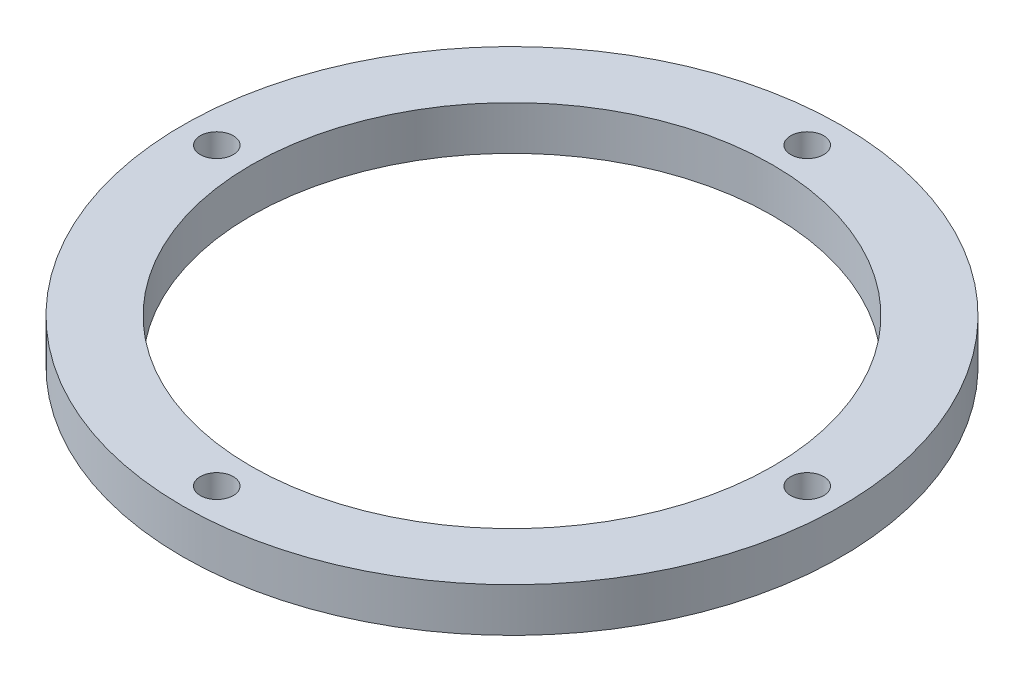
ISO-10303-21;
HEADER;
FILE_DESCRIPTION(('STEP AP214'),'2;1');
FILE_NAME('part.step','',(''),(''),'','','');
FILE_SCHEMA(('AUTOMOTIVE_DESIGN { 1 0 10303 214 1 1 1 1 }'));
ENDSEC;
DATA;
#1=APPLICATION_CONTEXT('core data for automotive mechanical design processes');
#2=APPLICATION_PROTOCOL_DEFINITION('international standard','automotive_design',2000,#1);
#3=PRODUCT_CONTEXT('',#1,'mechanical');
#4=PRODUCT('Part','Part','',(#3));
#5=PRODUCT_RELATED_PRODUCT_CATEGORY('part','',(#4));
#6=PRODUCT_DEFINITION_FORMATION('','',#4);
#7=PRODUCT_DEFINITION_CONTEXT('part definition',#1,'design');
#8=PRODUCT_DEFINITION('design','',#6,#7);
#9=PRODUCT_DEFINITION_SHAPE('','',#8);
#10=(LENGTH_UNIT() NAMED_UNIT(*) SI_UNIT(.MILLI.,.METRE.));
#11=(NAMED_UNIT(*) PLANE_ANGLE_UNIT() SI_UNIT($,.RADIAN.));
#12=(NAMED_UNIT(*) SI_UNIT($,.STERADIAN.) SOLID_ANGLE_UNIT());
#13=UNCERTAINTY_MEASURE_WITH_UNIT(LENGTH_MEASURE(1.E-05),#10,'distance_accuracy_value','');
#14=(GEOMETRIC_REPRESENTATION_CONTEXT(3) GLOBAL_UNCERTAINTY_ASSIGNED_CONTEXT((#13)) GLOBAL_UNIT_ASSIGNED_CONTEXT((#10,
#11,#12)) REPRESENTATION_CONTEXT('',''));
#15=CARTESIAN_POINT('',(0.,0.,0.));
#16=DIRECTION('',(0.,0.,1.));
#17=DIRECTION('',(1.,0.,0.));
#18=AXIS2_PLACEMENT_3D('',#15,#16,#17);
#19=CARTESIAN_POINT('',(-1.87667121962818E-13,8.,53.75));
#20=DIRECTION('',(0.,-1.,0.));
#21=DIRECTION('',(0.,0.,-1.));
#22=AXIS2_PLACEMENT_3D('',#19,#20,#21);
#23=CYLINDRICAL_SURFACE('',#22,3.);
#24=CARTESIAN_POINT('',(-1.87667121962818E-13,8.,53.75));
#25=DIRECTION('',(0.,1.,0.));
#26=DIRECTION('',(0.,0.,1.));
#27=AXIS2_PLACEMENT_3D('',#24,#25,#26);
#28=CIRCLE('',#27,3.);
#29=CARTESIAN_POINT('',(-1.87667121962818E-13,8.,56.75));
#30=VERTEX_POINT('',#29);
#31=EDGE_CURVE('E43',#30,#30,#28,.T.);
#32=ORIENTED_EDGE('',*,*,#31,.T.);
#33=EDGE_LOOP('',(#32));
#34=FACE_BOUND('',#33,.T.);
#35=CARTESIAN_POINT('',(-1.87667121962818E-13,0.,53.75));
#36=DIRECTION('',(0.,1.,0.));
#37=DIRECTION('',(0.,0.,1.));
#38=AXIS2_PLACEMENT_3D('',#35,#36,#37);
#39=CIRCLE('',#38,3.);
#40=CARTESIAN_POINT('',(-1.87667121962818E-13,0.,56.75));
#41=VERTEX_POINT('',#40);
#42=EDGE_CURVE('E63',#41,#41,#39,.T.);
#43=ORIENTED_EDGE('',*,*,#42,.F.);
#44=EDGE_LOOP('',(#43));
#45=FACE_BOUND('',#44,.T.);
#46=ADVANCED_FACE('F35',(#34,#45),#23,.F.);
#47=CARTESIAN_POINT('',(-53.75,8.,-3.75334243925637E-13));
#48=DIRECTION('',(0.,-1.,0.));
#49=DIRECTION('',(0.,0.,-1.));
#50=AXIS2_PLACEMENT_3D('',#47,#48,#49);
#51=CYLINDRICAL_SURFACE('',#50,3.);
#52=CARTESIAN_POINT('',(-53.75,8.,-3.75334243925637E-13));
#53=DIRECTION('',(0.,1.,0.));
#54=DIRECTION('',(0.,0.,1.));
#55=AXIS2_PLACEMENT_3D('',#52,#53,#54);
#56=CIRCLE('',#55,3.);
#57=CARTESIAN_POINT('',(-53.75,8.,2.99999999999963));
#58=VERTEX_POINT('',#57);
#59=EDGE_CURVE('E48',#58,#58,#56,.T.);
#60=ORIENTED_EDGE('',*,*,#59,.T.);
#61=EDGE_LOOP('',(#60));
#62=FACE_BOUND('',#61,.T.);
#63=CARTESIAN_POINT('',(-53.75,0.,-3.75334243925637E-13));
#64=DIRECTION('',(0.,1.,0.));
#65=DIRECTION('',(0.,0.,1.));
#66=AXIS2_PLACEMENT_3D('',#63,#64,#65);
#67=CIRCLE('',#66,3.);
#68=CARTESIAN_POINT('',(-53.75,0.,2.99999999999963));
#69=VERTEX_POINT('',#68);
#70=EDGE_CURVE('E61',#69,#69,#67,.T.);
#71=ORIENTED_EDGE('',*,*,#70,.F.);
#72=EDGE_LOOP('',(#71));
#73=FACE_BOUND('',#72,.T.);
#74=ADVANCED_FACE('F84',(#62,#73),#51,.F.);
#75=CARTESIAN_POINT('',(5.63001365888455E-13,8.,-53.75));
#76=DIRECTION('',(0.,-1.,0.));
#77=DIRECTION('',(0.,0.,-1.));
#78=AXIS2_PLACEMENT_3D('',#75,#76,#77);
#79=CYLINDRICAL_SURFACE('',#78,3.);
#80=CARTESIAN_POINT('',(5.63001365888455E-13,8.,-53.75));
#81=DIRECTION('',(0.,1.,0.));
#82=DIRECTION('',(0.,0.,1.));
#83=AXIS2_PLACEMENT_3D('',#80,#81,#82);
#84=CIRCLE('',#83,3.);
#85=CARTESIAN_POINT('',(5.63001365888455E-13,8.,-50.75));
#86=VERTEX_POINT('',#85);
#87=EDGE_CURVE('E77',#86,#86,#84,.T.);
#88=ORIENTED_EDGE('',*,*,#87,.T.);
#89=EDGE_LOOP('',(#88));
#90=FACE_BOUND('',#89,.T.);
#91=CARTESIAN_POINT('',(5.63001365888455E-13,0.,-53.75));
#92=DIRECTION('',(0.,1.,0.));
#93=DIRECTION('',(0.,0.,1.));
#94=AXIS2_PLACEMENT_3D('',#91,#92,#93);
#95=CIRCLE('',#94,3.);
#96=CARTESIAN_POINT('',(5.63001365888455E-13,0.,-50.75));
#97=VERTEX_POINT('',#96);
#98=EDGE_CURVE('E58',#97,#97,#95,.T.);
#99=ORIENTED_EDGE('',*,*,#98,.F.);
#100=EDGE_LOOP('',(#99));
#101=FACE_BOUND('',#100,.T.);
#102=ADVANCED_FACE('F102',(#90,#101),#79,.F.);
#103=CARTESIAN_POINT('',(53.75,8.,0.));
#104=DIRECTION('',(0.,-1.,0.));
#105=DIRECTION('',(0.,0.,-1.));
#106=AXIS2_PLACEMENT_3D('',#103,#104,#105);
#107=CYLINDRICAL_SURFACE('',#106,3.);
#108=CARTESIAN_POINT('',(53.75,8.,0.));
#109=DIRECTION('',(0.,1.,0.));
#110=DIRECTION('',(0.,0.,1.));
#111=AXIS2_PLACEMENT_3D('',#108,#109,#110);
#112=CIRCLE('',#111,3.);
#113=CARTESIAN_POINT('',(53.75,8.,3.));
#114=VERTEX_POINT('',#113);
#115=EDGE_CURVE('E72',#114,#114,#112,.T.);
#116=ORIENTED_EDGE('',*,*,#115,.T.);
#117=EDGE_LOOP('',(#116));
#118=FACE_BOUND('',#117,.T.);
#119=CARTESIAN_POINT('',(53.75,0.,0.));
#120=DIRECTION('',(0.,1.,0.));
#121=DIRECTION('',(0.,0.,1.));
#122=AXIS2_PLACEMENT_3D('',#119,#120,#121);
#123=CIRCLE('',#122,3.);
#124=CARTESIAN_POINT('',(53.75,0.,3.));
#125=VERTEX_POINT('',#124);
#126=EDGE_CURVE('E55',#125,#125,#123,.T.);
#127=ORIENTED_EDGE('',*,*,#126,.F.);
#128=EDGE_LOOP('',(#127));
#129=FACE_BOUND('',#128,.T.);
#130=ADVANCED_FACE('F108',(#118,#129),#107,.F.);
#131=CARTESIAN_POINT('',(0.,8.,0.));
#132=DIRECTION('',(0.,-1.,0.));
#133=DIRECTION('',(0.,0.,-1.));
#134=AXIS2_PLACEMENT_3D('',#131,#132,#133);
#135=CYLINDRICAL_SURFACE('',#134,60.);
#136=CARTESIAN_POINT('',(0.,8.,0.));
#137=DIRECTION('',(0.,1.,0.));
#138=DIRECTION('',(0.,0.,1.));
#139=AXIS2_PLACEMENT_3D('',#136,#137,#138);
#140=CIRCLE('',#139,60.);
#141=CARTESIAN_POINT('',(0.,8.,60.));
#142=VERTEX_POINT('',#141);
#143=EDGE_CURVE('E68',#142,#142,#140,.T.);
#144=ORIENTED_EDGE('',*,*,#143,.F.);
#145=EDGE_LOOP('',(#144));
#146=FACE_BOUND('',#145,.T.);
#147=CARTESIAN_POINT('',(0.,0.,0.));
#148=DIRECTION('',(0.,1.,0.));
#149=DIRECTION('',(0.,0.,1.));
#150=AXIS2_PLACEMENT_3D('',#147,#148,#149);
#151=CIRCLE('',#150,60.);
#152=CARTESIAN_POINT('',(0.,0.,60.));
#153=VERTEX_POINT('',#152);
#154=EDGE_CURVE('E52',#153,#153,#151,.T.);
#155=ORIENTED_EDGE('',*,*,#154,.T.);
#156=EDGE_LOOP('',(#155));
#157=FACE_BOUND('',#156,.T.);
#158=ADVANCED_FACE('F37',(#146,#157),#135,.T.);
#159=CARTESIAN_POINT('',(0.,8.,0.));
#160=DIRECTION('',(0.,-1.,0.));
#161=DIRECTION('',(0.,0.,-1.));
#162=AXIS2_PLACEMENT_3D('',#159,#160,#161);
#163=CYLINDRICAL_SURFACE('',#162,47.5);
#164=CARTESIAN_POINT('',(0.,8.,0.));
#165=DIRECTION('',(0.,1.,0.));
#166=DIRECTION('',(0.,0.,1.));
#167=AXIS2_PLACEMENT_3D('',#164,#165,#166);
#168=CIRCLE('',#167,47.5);
#169=CARTESIAN_POINT('',(0.,8.,47.5));
#170=VERTEX_POINT('',#169);
#171=EDGE_CURVE('E10',#170,#170,#168,.T.);
#172=ORIENTED_EDGE('',*,*,#171,.T.);
#173=EDGE_LOOP('',(#172));
#174=FACE_BOUND('',#173,.T.);
#175=CARTESIAN_POINT('',(0.,0.,0.));
#176=DIRECTION('',(0.,1.,0.));
#177=DIRECTION('',(0.,0.,1.));
#178=AXIS2_PLACEMENT_3D('',#175,#176,#177);
#179=CIRCLE('',#178,47.5);
#180=CARTESIAN_POINT('',(0.,0.,47.5));
#181=VERTEX_POINT('',#180);
#182=EDGE_CURVE('E39',#181,#181,#179,.T.);
#183=ORIENTED_EDGE('',*,*,#182,.F.);
#184=EDGE_LOOP('',(#183));
#185=FACE_BOUND('',#184,.T.);
#186=ADVANCED_FACE('F91',(#174,#185),#163,.F.);
#187=CARTESIAN_POINT('',(0.,8.,0.));
#188=DIRECTION('',(0.,1.,0.));
#189=DIRECTION('',(0.,0.,1.));
#190=AXIS2_PLACEMENT_3D('',#187,#188,#189);
#191=PLANE('',#190);
#192=ORIENTED_EDGE('',*,*,#143,.T.);
#193=EDGE_LOOP('',(#192));
#194=FACE_BOUND('',#193,.T.);
#195=ORIENTED_EDGE('',*,*,#115,.F.);
#196=EDGE_LOOP('',(#195));
#197=FACE_BOUND('',#196,.T.);
#198=ORIENTED_EDGE('',*,*,#87,.F.);
#199=EDGE_LOOP('',(#198));
#200=FACE_BOUND('',#199,.T.);
#201=ORIENTED_EDGE('',*,*,#59,.F.);
#202=EDGE_LOOP('',(#201));
#203=FACE_BOUND('',#202,.T.);
#204=ORIENTED_EDGE('',*,*,#31,.F.);
#205=EDGE_LOOP('',(#204));
#206=FACE_BOUND('',#205,.T.);
#207=ORIENTED_EDGE('',*,*,#171,.F.);
#208=EDGE_LOOP('',(#207));
#209=FACE_BOUND('',#208,.T.);
#210=ADVANCED_FACE('F87',(#194,#197,#200,#203,#206,#209),#191,.T.);
#211=CARTESIAN_POINT('',(0.,0.,0.));
#212=DIRECTION('',(0.,1.,0.));
#213=DIRECTION('',(0.,0.,1.));
#214=AXIS2_PLACEMENT_3D('',#211,#212,#213);
#215=PLANE('',#214);
#216=ORIENTED_EDGE('',*,*,#154,.F.);
#217=EDGE_LOOP('',(#216));
#218=FACE_BOUND('',#217,.T.);
#219=ORIENTED_EDGE('',*,*,#126,.T.);
#220=EDGE_LOOP('',(#219));
#221=FACE_BOUND('',#220,.T.);
#222=ORIENTED_EDGE('',*,*,#98,.T.);
#223=EDGE_LOOP('',(#222));
#224=FACE_BOUND('',#223,.T.);
#225=ORIENTED_EDGE('',*,*,#70,.T.);
#226=EDGE_LOOP('',(#225));
#227=FACE_BOUND('',#226,.T.);
#228=ORIENTED_EDGE('',*,*,#42,.T.);
#229=EDGE_LOOP('',(#228));
#230=FACE_BOUND('',#229,.T.);
#231=ORIENTED_EDGE('',*,*,#182,.T.);
#232=EDGE_LOOP('',(#231));
#233=FACE_BOUND('',#232,.T.);
#234=ADVANCED_FACE('F90',(#218,#221,#224,#227,#230,#233),#215,.F.);
#235=CLOSED_SHELL('',(#46,#74,#102,#130,#158,#186,#210,#234));
#236=MANIFOLD_SOLID_BREP('B2',#235);
#237=ADVANCED_BREP_SHAPE_REPRESENTATION('',(#18,#236),#14);
#238=SHAPE_DEFINITION_REPRESENTATION(#9,#237);
ENDSEC;
END-ISO-10303-21;
